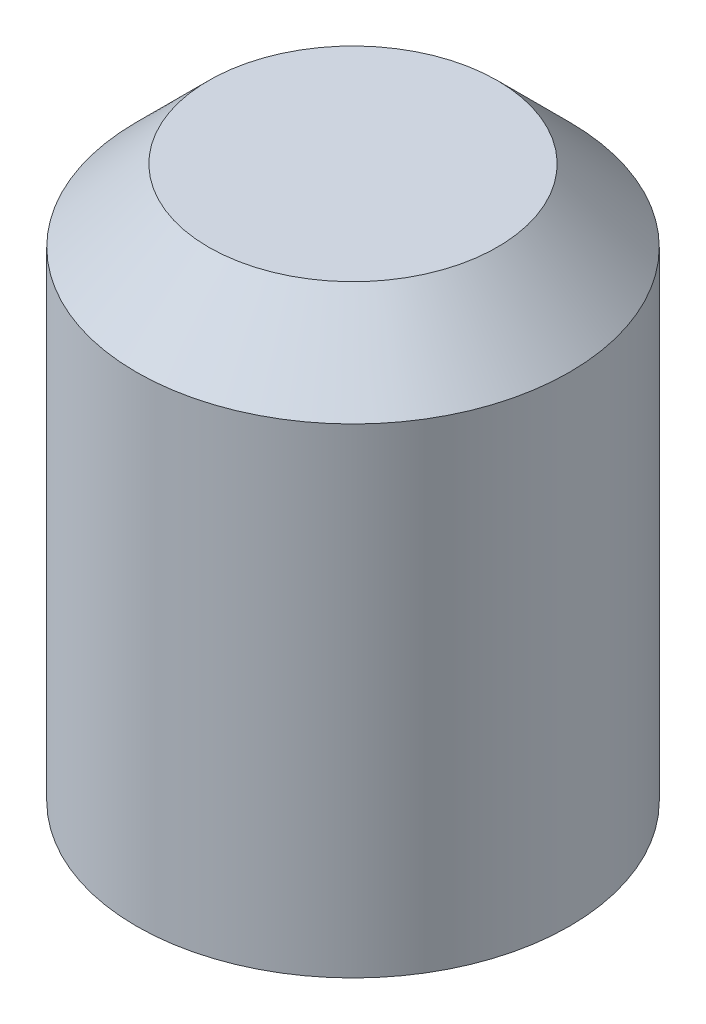
ISO-10303-21;
HEADER;
FILE_DESCRIPTION(('STEP AP214'),'2;1');
FILE_NAME('part.step','',(''),(''),'','','');
FILE_SCHEMA(('AUTOMOTIVE_DESIGN { 1 0 10303 214 1 1 1 1 }'));
ENDSEC;
DATA;
#1=APPLICATION_CONTEXT('core data for automotive mechanical design processes');
#2=APPLICATION_PROTOCOL_DEFINITION('international standard','automotive_design',2000,#1);
#3=PRODUCT_CONTEXT('',#1,'mechanical');
#4=PRODUCT('Part','Part','',(#3));
#5=PRODUCT_RELATED_PRODUCT_CATEGORY('part','',(#4));
#6=PRODUCT_DEFINITION_FORMATION('','',#4);
#7=PRODUCT_DEFINITION_CONTEXT('part definition',#1,'design');
#8=PRODUCT_DEFINITION('design','',#6,#7);
#9=PRODUCT_DEFINITION_SHAPE('','',#8);
#10=(LENGTH_UNIT() NAMED_UNIT(*) SI_UNIT(.MILLI.,.METRE.));
#11=(NAMED_UNIT(*) PLANE_ANGLE_UNIT() SI_UNIT($,.RADIAN.));
#12=(NAMED_UNIT(*) SI_UNIT($,.STERADIAN.) SOLID_ANGLE_UNIT());
#13=UNCERTAINTY_MEASURE_WITH_UNIT(LENGTH_MEASURE(1.E-05),#10,'distance_accuracy_value','');
#14=(GEOMETRIC_REPRESENTATION_CONTEXT(3) GLOBAL_UNCERTAINTY_ASSIGNED_CONTEXT((#13)) GLOBAL_UNIT_ASSIGNED_CONTEXT((#10,
#11,#12)) REPRESENTATION_CONTEXT('',''));
#15=CARTESIAN_POINT('',(0.,0.,0.));
#16=DIRECTION('',(0.,0.,1.));
#17=DIRECTION('',(1.,0.,0.));
#18=AXIS2_PLACEMENT_3D('',#15,#16,#17);
#19=CARTESIAN_POINT('',(-5.4,-6.05,0.));
#20=DIRECTION('',(0.,1.,0.));
#21=DIRECTION('',(0.,0.,1.));
#22=AXIS2_PLACEMENT_3D('',#19,#20,#21);
#23=PLANE('',#22);
#24=DIRECTION('',(-1.,0.,0.));
#25=VECTOR('',#24,1.);
#26=CARTESIAN_POINT('',(-5.83301270189222,-6.05,-0.75));
#27=LINE('',#26,#25);
#28=CARTESIAN_POINT('',(-5.83301270189222,-6.05,-0.75));
#29=VERTEX_POINT('',#28);
#30=CARTESIAN_POINT('',(-4.96698729810778,-6.05,-0.75));
#31=VERTEX_POINT('',#30);
#32=EDGE_CURVE('E116',#29,#31,#27,.F.);
#33=ORIENTED_EDGE('',*,*,#32,.T.);
#34=DIRECTION('',(-0.5,0.,-0.866025403784439));
#35=VECTOR('',#34,1.);
#36=CARTESIAN_POINT('',(-4.96698729810778,-6.05,-0.75));
#37=LINE('',#36,#35);
#38=CARTESIAN_POINT('',(-4.53397459621556,-6.05,0.));
#39=VERTEX_POINT('',#38);
#40=EDGE_CURVE('E82',#31,#39,#37,.F.);
#41=ORIENTED_EDGE('',*,*,#40,.T.);
#42=DIRECTION('',(0.5,0.,-0.866025403784439));
#43=VECTOR('',#42,1.);
#44=CARTESIAN_POINT('',(-4.53397459621556,-6.05,0.));
#45=LINE('',#44,#43);
#46=CARTESIAN_POINT('',(-4.96698729810778,-6.05,0.75));
#47=VERTEX_POINT('',#46);
#48=EDGE_CURVE('E84',#39,#47,#45,.F.);
#49=ORIENTED_EDGE('',*,*,#48,.T.);
#50=DIRECTION('',(1.,0.,0.));
#51=VECTOR('',#50,1.);
#52=CARTESIAN_POINT('',(-4.96698729810778,-6.05,0.75));
#53=LINE('',#52,#51);
#54=CARTESIAN_POINT('',(-5.83301270189222,-6.05,0.75));
#55=VERTEX_POINT('',#54);
#56=EDGE_CURVE('E85',#47,#55,#53,.F.);
#57=ORIENTED_EDGE('',*,*,#56,.T.);
#58=DIRECTION('',(0.5,0.,0.866025403784439));
#59=VECTOR('',#58,1.);
#60=CARTESIAN_POINT('',(-5.83301270189222,-6.05,0.75));
#61=LINE('',#60,#59);
#62=CARTESIAN_POINT('',(-6.26602540378444,-6.05,0.));
#63=VERTEX_POINT('',#62);
#64=EDGE_CURVE('E71',#55,#63,#61,.F.);
#65=ORIENTED_EDGE('',*,*,#64,.T.);
#66=DIRECTION('',(-0.5,0.,0.866025403784439));
#67=VECTOR('',#66,1.);
#68=CARTESIAN_POINT('',(-6.26602540378444,-6.05,0.));
#69=LINE('',#68,#67);
#70=EDGE_CURVE('E105',#63,#29,#69,.F.);
#71=ORIENTED_EDGE('',*,*,#70,.T.);
#72=EDGE_LOOP('',(#33,#41,#49,#57,#65,#71));
#73=FACE_BOUND('',#72,.T.);
#74=ADVANCED_FACE('F17',(#73),#23,.F.);
#75=CARTESIAN_POINT('',(-4.96698729810778,-7.25,0.75));
#76=DIRECTION('',(0.,0.,1.));
#77=DIRECTION('',(1.,0.,0.));
#78=AXIS2_PLACEMENT_3D('',#75,#76,#77);
#79=PLANE('',#78);
#80=DIRECTION('',(0.,1.,0.));
#81=VECTOR('',#80,1.);
#82=CARTESIAN_POINT('',(-5.83301270189222,-7.25,0.75));
#83=LINE('',#82,#81);
#84=CARTESIAN_POINT('',(-5.83301270192332,-7.24999999999689,0.749999999922893));
#85=VERTEX_POINT('',#84);
#86=EDGE_CURVE('E91',#85,#55,#83,.T.);
#87=ORIENTED_EDGE('',*,*,#86,.T.);
#88=ORIENTED_EDGE('',*,*,#56,.F.);
#89=DIRECTION('',(0.,1.,0.));
#90=VECTOR('',#89,1.);
#91=CARTESIAN_POINT('',(-4.96698729810778,-7.25,0.75));
#92=LINE('',#91,#90);
#93=CARTESIAN_POINT('',(-4.96698729813004,-7.25000000000077,0.749999999961446));
#94=VERTEX_POINT('',#93);
#95=EDGE_CURVE('E58',#47,#94,#92,.F.);
#96=ORIENTED_EDGE('',*,*,#95,.T.);
#97=CARTESIAN_POINT('',(-4.96698729813633,-7.25000000002462,0.749999999990233));
#98=CARTESIAN_POINT('',(-5.00253334721182,-7.23973766484959,0.749999999996492));
#99=CARTESIAN_POINT('',(-5.03836059709235,-7.23034220749079,0.74999999999906));
#100=CARTESIAN_POINT('',(-5.11059708571942,-7.21373690239262,0.750000000000942));
#101=CARTESIAN_POINT('',(-5.14700743835464,-7.20653194482124,0.75000000000025));
#102=CARTESIAN_POINT('',(-5.21941958689425,-7.1949455007837,0.749999999999756));
#103=CARTESIAN_POINT('',(-5.25541118774583,-7.19050224024818,0.749999999999935));
#104=CARTESIAN_POINT('',(-5.32760203794008,-7.18453742652163,0.750000000000065));
#105=CARTESIAN_POINT('',(-5.36380101896727,-7.18301270192084,0.750000000000017));
#106=CARTESIAN_POINT('',(-5.43619898102244,-7.18301270192055,0.749999999999983));
#107=CARTESIAN_POINT('',(-5.47239796205041,-7.18453742652112,0.749999999999995));
#108=CARTESIAN_POINT('',(-5.54458881224627,-7.19050224024725,0.750000000000005));
#109=CARTESIAN_POINT('',(-5.58058041309869,-7.19494550078256,0.750000000000001));
#110=CARTESIAN_POINT('',(-5.65299256163985,-7.20653194482036,0.749999999999999));
#111=CARTESIAN_POINT('',(-5.68940291427578,-7.21373690239221,0.749999999999999));
#112=CARTESIAN_POINT('',(-5.76163940290473,-7.23034220748943,0.750000000000001));
#113=CARTESIAN_POINT('',(-5.79746665278644,-7.23973766484681,0.750000000000001));
#114=CARTESIAN_POINT('',(-5.83301270186367,-7.25000000001823,0.75));
#115=B_SPLINE_CURVE_WITH_KNOTS('',3,(#97,#98,#99,#100,#101,#102,#103,#104,#105,#106,#107,#108,
#109,#110,#111,#112,#113,#114),.UNSPECIFIED.,.F.,.F.,(4,2,2,2,2,2,2,2,4),(0.,0.111027523460428,
0.222301119765626,0.330986572162821,0.439553854962632,0.548121137764763,0.656806590164309,
0.768080186471947,0.879107709934705),.UNSPECIFIED.);
#116=EDGE_CURVE('E20',#94,#85,#115,.T.);
#117=ORIENTED_EDGE('',*,*,#116,.T.);
#118=EDGE_LOOP('',(#87,#88,#96,#117));
#119=FACE_BOUND('',#118,.T.);
#120=ADVANCED_FACE('F89',(#119),#79,.F.);
#121=CARTESIAN_POINT('',(-4.53397459621556,-7.25,0.));
#122=DIRECTION('',(0.866025403784439,0.,0.5));
#123=DIRECTION('',(0.5,0.,-0.866025403784439));
#124=AXIS2_PLACEMENT_3D('',#121,#122,#123);
#125=PLANE('',#124);
#126=ORIENTED_EDGE('',*,*,#95,.F.);
#127=ORIENTED_EDGE('',*,*,#48,.F.);
#128=DIRECTION('',(0.,1.,0.));
#129=VECTOR('',#128,1.);
#130=CARTESIAN_POINT('',(-4.53397459621556,-7.25,0.));
#131=LINE('',#130,#129);
#132=CARTESIAN_POINT('',(-4.53397459626008,-7.25000000000077,0.));
#133=VERTEX_POINT('',#132);
#134=EDGE_CURVE('E97',#39,#133,#131,.F.);
#135=ORIENTED_EDGE('',*,*,#134,.T.);
#136=CARTESIAN_POINT('',(-4.53397459623829,-7.25000000002462,1.98427768303885E-11));
#137=CARTESIAN_POINT('',(-4.55300288193605,-7.23901082830645,0.0329579576418092));
#138=CARTESIAN_POINT('',(-4.57219541964067,-7.22901675269572,0.0662004080775304));
#139=CARTESIAN_POINT('',(-4.61091280108104,-7.21157239453197,0.133260879872035));
#140=CARTESIAN_POINT('',(-4.63043833252598,-7.20412828245993,0.167080092378077));
#141=CARTESIAN_POINT('',(-4.66924742521379,-7.1925409848509,0.234299412708026));
#142=CARTESIAN_POINT('',(-4.68852501685474,-7.18832067044876,0.267689180878064));
#143=CARTESIAN_POINT('',(-4.72717086026949,-7.18328343804382,0.334625745174027));
#144=CARTESIAN_POINT('',(-4.74653897167252,-7.18246234777618,0.368172298170642));
#145=CARTESIAN_POINT('',(-4.78272621006236,-7.1841748588689,0.430850433647387));
#146=CARTESIAN_POINT('',(-4.79955076723974,-7.18628798200753,0.459991421493473));
#147=CARTESIAN_POINT('',(-4.83309027509369,-7.19298398781146,0.518083553157391));
#148=CARTESIAN_POINT('',(-4.84980510985265,-7.19756915558054,0.547034496200022));
#149=CARTESIAN_POINT('',(-4.88341371225658,-7.2090311875406,0.605246303134993));
#150=CARTESIAN_POINT('',(-4.90030322842515,-7.21595661586676,0.634499803254222));
#151=CARTESIAN_POINT('',(-4.93383042648646,-7.23167441034119,0.692570613731831));
#152=CARTESIAN_POINT('',(-4.95046853757001,-7.24046308580387,0.721388667470523));
#153=CARTESIAN_POINT('',(-4.96698729809358,-7.25000000001827,0.749999999975404));
#154=B_SPLINE_CURVE_WITH_KNOTS('',3,(#136,#137,#138,#139,#140,#141,#142,#143,#144,#145,#146,
#147,#148,#149,#150,#151,#152,#153),.UNSPECIFIED.,.F.,.F.,(4,2,2,2,2,2,2,2,4),(0.,
0.118881004358965,0.238047681439854,0.354265352356804,0.47034033338114,0.571390418521876,
0.672534072698116,0.775920608446918,0.879104240070542),.UNSPECIFIED.);
#155=EDGE_CURVE('E95',#133,#94,#154,.T.);
#156=ORIENTED_EDGE('',*,*,#155,.T.);
#157=EDGE_LOOP('',(#126,#127,#135,#156));
#158=FACE_BOUND('',#157,.T.);
#159=ADVANCED_FACE('F93',(#158),#125,.F.);
#160=CARTESIAN_POINT('',(-4.96698729810778,-7.25,-0.75));
#161=DIRECTION('',(0.866025403784439,0.,-0.5));
#162=DIRECTION('',(-0.5,0.,-0.866025403784439));
#163=AXIS2_PLACEMENT_3D('',#160,#161,#162);
#164=PLANE('',#163);
#165=ORIENTED_EDGE('',*,*,#134,.F.);
#166=ORIENTED_EDGE('',*,*,#40,.F.);
#167=DIRECTION('',(0.,1.,0.));
#168=VECTOR('',#167,1.);
#169=CARTESIAN_POINT('',(-4.96698729810778,-7.25,-0.75));
#170=LINE('',#169,#168);
#171=CARTESIAN_POINT('',(-4.96698729813004,-7.25000000000077,-0.749999999961447));
#172=VERTEX_POINT('',#171);
#173=EDGE_CURVE('E108',#31,#172,#170,.F.);
#174=ORIENTED_EDGE('',*,*,#173,.T.);
#175=CARTESIAN_POINT('',(-4.96698729810196,-7.25000000002462,-0.749999999970391));
#176=CARTESIAN_POINT('',(-4.94795901239337,-7.23901082830645,-0.717042042354683));
#177=CARTESIAN_POINT('',(-4.9287664746843,-7.22901675269572,-0.68379959192153));
#178=CARTESIAN_POINT('',(-4.89004909324067,-7.21157239453197,-0.616739120128908));
#179=CARTESIAN_POINT('',(-4.87052356179693,-7.20412828245993,-0.582919907622173));
#180=CARTESIAN_POINT('',(-4.83171446910997,-7.1925409848509,-0.515700587291732));
#181=CARTESIAN_POINT('',(-4.81243687746872,-7.18832067044876,-0.482310819121872));
#182=CARTESIAN_POINT('',(-4.77379103405374,-7.18328343804382,-0.415374254826039));
#183=CARTESIAN_POINT('',(-4.75442292265079,-7.18246234777618,-0.381827701829375));
#184=CARTESIAN_POINT('',(-4.718235684261,-7.1841748588689,-0.3191495663526));
#185=CARTESIAN_POINT('',(-4.70141112708361,-7.18628798200753,-0.290008578506525));
#186=CARTESIAN_POINT('',(-4.66787161922964,-7.19298398781146,-0.231916446842614));
#187=CARTESIAN_POINT('',(-4.65115678447069,-7.19756915558054,-0.20296550379998));
#188=CARTESIAN_POINT('',(-4.61754818206677,-7.2090311875406,-0.144753696865007));
#189=CARTESIAN_POINT('',(-4.60065866589819,-7.21595661586676,-0.115500196745779));
#190=CARTESIAN_POINT('',(-4.56713146783688,-7.23167441034119,-0.0574293862681701));
#191=CARTESIAN_POINT('',(-4.55049335675333,-7.24046308580387,-0.0286113325294788));
#192=CARTESIAN_POINT('',(-4.53397459622976,-7.25000000001827,-2.45963588615092E-11));
#193=B_SPLINE_CURVE_WITH_KNOTS('',3,(#175,#176,#177,#178,#179,#180,#181,#182,#183,#184,#185,
#186,#187,#188,#189,#190,#191,#192),.UNSPECIFIED.,.F.,.F.,(4,2,2,2,2,2,2,2,4),(0.,
0.118881004358965,0.238047681439854,0.354265352356803,0.470340333381139,0.571390418521875,
0.672534072698115,0.775920608446917,0.879104240070541),.UNSPECIFIED.);
#194=EDGE_CURVE('E190',#172,#133,#193,.T.);
#195=ORIENTED_EDGE('',*,*,#194,.T.);
#196=EDGE_LOOP('',(#165,#166,#174,#195));
#197=FACE_BOUND('',#196,.T.);
#198=ADVANCED_FACE('F199',(#197),#164,.F.);
#199=CARTESIAN_POINT('',(-5.83301270189222,-7.25,-0.75));
#200=DIRECTION('',(0.,0.,-1.));
#201=DIRECTION('',(-1.,0.,0.));
#202=AXIS2_PLACEMENT_3D('',#199,#200,#201);
#203=PLANE('',#202);
#204=ORIENTED_EDGE('',*,*,#173,.F.);
#205=ORIENTED_EDGE('',*,*,#32,.F.);
#206=DIRECTION('',(0.,1.,0.));
#207=VECTOR('',#206,1.);
#208=CARTESIAN_POINT('',(-5.83301270189222,-7.25,-0.75));
#209=LINE('',#208,#207);
#210=CARTESIAN_POINT('',(-5.83301270186996,-7.25000000000788,-0.749999999961447));
#211=VERTEX_POINT('',#210);
#212=EDGE_CURVE('E107',#29,#211,#209,.F.);
#213=ORIENTED_EDGE('',*,*,#212,.T.);
#214=CARTESIAN_POINT('',(-5.8330127018724,-7.25000000002356,-0.749999999995703));
#215=CARTESIAN_POINT('',(-5.79746665279532,-7.23973766485022,-0.749999999998457));
#216=CARTESIAN_POINT('',(-5.7616394029135,-7.23034220749189,-0.749999999999586));
#217=CARTESIAN_POINT('',(-5.68940291428408,-7.21373690239366,-0.750000000000415));
#218=CARTESIAN_POINT('',(-5.65299256164779,-7.20653194482175,-0.75000000000011));
#219=CARTESIAN_POINT('',(-5.58058041310595,-7.19494550078361,-0.749999999999893));
#220=CARTESIAN_POINT('',(-5.5445888122532,-7.19050224024802,-0.749999999999971));
#221=CARTESIAN_POINT('',(-5.47239796205666,-7.18453742652144,-0.750000000000029));
#222=CARTESIAN_POINT('',(-5.43619898102833,-7.18301270192069,-0.750000000000008));
#223=CARTESIAN_POINT('',(-5.36380101897247,-7.1830127019207,-0.749999999999992));
#224=CARTESIAN_POINT('',(-5.32760203794494,-7.18453742652139,-0.749999999999998));
#225=CARTESIAN_POINT('',(-5.25541118774995,-7.19050224024768,-0.750000000000002));
#226=CARTESIAN_POINT('',(-5.21941958689797,-7.19494550078303,-0.750000000000001));
#227=CARTESIAN_POINT('',(-5.14700743835774,-7.20653194482082,-0.749999999999999));
#228=CARTESIAN_POINT('',(-5.11059708572229,-7.21373690239262,-0.75));
#229=CARTESIAN_POINT('',(-5.0383605970943,-7.23034220748968,-0.75));
#230=CARTESIAN_POINT('',(-5.00253334721309,-7.23973766484695,-0.750000000000001));
#231=CARTESIAN_POINT('',(-4.96698729813633,-7.25000000001823,-0.75));
#232=B_SPLINE_CURVE_WITH_KNOTS('',3,(#214,#215,#216,#217,#218,#219,#220,#221,#222,#223,#224,
#225,#226,#227,#228,#229,#230,#231),.UNSPECIFIED.,.F.,.F.,(4,2,2,2,2,2,2,2,4),(0.,
0.111027523463793,0.222301119772486,0.330986572173132,0.439553854976337,0.548121137777162,
0.65680659017543,0.768080186481618,0.879107709942885),.UNSPECIFIED.);
#233=EDGE_CURVE('E184',#211,#172,#232,.T.);
#234=ORIENTED_EDGE('',*,*,#233,.T.);
#235=EDGE_LOOP('',(#204,#205,#213,#234));
#236=FACE_BOUND('',#235,.T.);
#237=ADVANCED_FACE('F195',(#236),#203,.F.);
#238=CARTESIAN_POINT('',(-6.26602540378444,-7.25,0.));
#239=DIRECTION('',(-0.866025403784439,0.,-0.5));
#240=DIRECTION('',(-0.5,0.,0.866025403784439));
#241=AXIS2_PLACEMENT_3D('',#238,#239,#240);
#242=PLANE('',#241);
#243=ORIENTED_EDGE('',*,*,#212,.F.);
#244=ORIENTED_EDGE('',*,*,#70,.F.);
#245=DIRECTION('',(0.,1.,0.));
#246=VECTOR('',#245,1.);
#247=CARTESIAN_POINT('',(-6.26602540378444,-7.25,0.));
#248=LINE('',#247,#246);
#249=CARTESIAN_POINT('',(-6.26602540373992,-7.25000000000077,0.));
#250=VERTEX_POINT('',#249);
#251=EDGE_CURVE('E39',#63,#250,#248,.F.);
#252=ORIENTED_EDGE('',*,*,#251,.T.);
#253=CARTESIAN_POINT('',(-6.2660254037617,-7.25000000002462,-1.98433030964582E-11));
#254=CARTESIAN_POINT('',(-6.24699711806395,-7.23901082830645,-0.0329579576418126));
#255=CARTESIAN_POINT('',(-6.22780458035933,-7.22901675269572,-0.0662004080775363));
#256=CARTESIAN_POINT('',(-6.18908719891896,-7.21157239453197,-0.133260879872046));
#257=CARTESIAN_POINT('',(-6.16956166747401,-7.20412828245993,-0.16708009237809));
#258=CARTESIAN_POINT('',(-6.1307525747862,-7.1925409848509,-0.23429941270804));
#259=CARTESIAN_POINT('',(-6.11147498314526,-7.18832067044876,-0.267689180878075));
#260=CARTESIAN_POINT('',(-6.07282913973051,-7.18328343804382,-0.334625745174033));
#261=CARTESIAN_POINT('',(-6.05346102832747,-7.18246234777618,-0.368172298170645));
#262=CARTESIAN_POINT('',(-6.01727378993727,-7.18417485886892,-0.43085043364802));
#263=CARTESIAN_POINT('',(-6.00044923275953,-7.18628798200762,-0.459991421494736));
#264=CARTESIAN_POINT('',(-5.96690972490485,-7.1929839878118,-0.518083553159906));
#265=CARTESIAN_POINT('',(-5.95019489014554,-7.19756915558106,-0.547034496203157));
#266=CARTESIAN_POINT('',(-5.91658628774089,-7.20903118754156,-0.605246303139383));
#267=CARTESIAN_POINT('',(-5.89969677157195,-7.215956615868,-0.634499803259246));
#268=CARTESIAN_POINT('',(-5.86616957350992,-7.23167441034301,-0.692570613738102));
#269=CARTESIAN_POINT('',(-5.84953146242602,-7.24046308580602,-0.721388667477405));
#270=CARTESIAN_POINT('',(-5.8330127019021,-7.25000000002077,-0.749999999982889));
#271=B_SPLINE_CURVE_WITH_KNOTS('',3,(#253,#254,#255,#256,#257,#258,#259,#260,#261,#262,#263,
#264,#265,#266,#267,#268,#269,#270),.UNSPECIFIED.,.F.,.F.,(4,2,2,2,2,2,2,2,4),(0.,
0.118881004358974,0.238047681439872,0.354265352356813,0.470340333381139,0.571390418524065,
0.672534072702501,0.775920608453614,0.879104240079532),.UNSPECIFIED.);
#272=EDGE_CURVE('E155',#250,#211,#271,.T.);
#273=ORIENTED_EDGE('',*,*,#272,.T.);
#274=EDGE_LOOP('',(#243,#244,#252,#273));
#275=FACE_BOUND('',#274,.T.);
#276=ADVANCED_FACE('F198',(#275),#242,.F.);
#277=CARTESIAN_POINT('',(-5.83301270189222,-7.25,0.75));
#278=DIRECTION('',(-0.866025403784439,0.,0.5));
#279=DIRECTION('',(0.5,0.,0.866025403784439));
#280=AXIS2_PLACEMENT_3D('',#277,#278,#279);
#281=PLANE('',#280);
#282=ORIENTED_EDGE('',*,*,#251,.F.);
#283=ORIENTED_EDGE('',*,*,#64,.F.);
#284=ORIENTED_EDGE('',*,*,#86,.F.);
#285=CARTESIAN_POINT('',(-5.83301270189804,-7.25000000002462,0.749999999970391));
#286=CARTESIAN_POINT('',(-5.85204098760663,-7.23901082830645,0.717042042354683));
#287=CARTESIAN_POINT('',(-5.8712335253157,-7.22901675269572,0.683799591921529));
#288=CARTESIAN_POINT('',(-5.90995090675933,-7.21157239453197,0.616739120128908));
#289=CARTESIAN_POINT('',(-5.92947643820307,-7.20412828245993,0.582919907622173));
#290=CARTESIAN_POINT('',(-5.96828553089003,-7.1925409848509,0.515700587291732));
#291=CARTESIAN_POINT('',(-5.98756312253128,-7.18832067044876,0.482310819121872));
#292=CARTESIAN_POINT('',(-6.02620896594626,-7.18328343804382,0.415374254826038));
#293=CARTESIAN_POINT('',(-6.04557707734921,-7.18246234777618,0.381827701829375));
#294=CARTESIAN_POINT('',(-6.081764315739,-7.1841748588689,0.3191495663526));
#295=CARTESIAN_POINT('',(-6.09858887291639,-7.18628798200753,0.290008578506524));
#296=CARTESIAN_POINT('',(-6.13212838077036,-7.19298398781146,0.231916446842615));
#297=CARTESIAN_POINT('',(-6.14884321552931,-7.19756915558054,0.202965503799981));
#298=CARTESIAN_POINT('',(-6.18245181793323,-7.2090311875406,0.144753696865008));
#299=CARTESIAN_POINT('',(-6.19934133410181,-7.21595661586676,0.115500196745779));
#300=CARTESIAN_POINT('',(-6.23286853216312,-7.23167441034119,0.0574293862681695));
#301=CARTESIAN_POINT('',(-6.24950664324667,-7.24046308580387,0.0286113325294778));
#302=CARTESIAN_POINT('',(-6.26602540377024,-7.25000000001827,2.45953151783073E-11));
#303=B_SPLINE_CURVE_WITH_KNOTS('',3,(#285,#286,#287,#288,#289,#290,#291,#292,#293,#294,#295,
#296,#297,#298,#299,#300,#301,#302),.UNSPECIFIED.,.F.,.F.,(4,2,2,2,2,2,2,2,4),(0.,
0.118881004358965,0.238047681439853,0.354265352356803,0.470340333381139,0.571390418521875,
0.672534072698114,0.775920608446917,0.879104240070542),.UNSPECIFIED.);
#304=EDGE_CURVE('E148',#85,#250,#303,.T.);
#305=ORIENTED_EDGE('',*,*,#304,.T.);
#306=EDGE_LOOP('',(#282,#283,#284,#305));
#307=FACE_BOUND('',#306,.T.);
#308=ADVANCED_FACE('F162',(#307),#281,.F.);
#309=CARTESIAN_POINT('',(-5.4,-7.24999999994225,0.));
#310=DIRECTION('',(0.,-1.,0.));
#311=DIRECTION('',(0.,0.,-1.));
#312=AXIS2_PLACEMENT_3D('',#309,#310,#311);
#313=CONICAL_SURFACE('',#312,0.86602540363856,1.04719755120955);
#314=ORIENTED_EDGE('',*,*,#116,.F.);
#315=CARTESIAN_POINT('',(-5.4,-7.24999999997507,0.));
#316=DIRECTION('',(0.,-1.,0.));
#317=DIRECTION('',(0.,0.,-1.));
#318=AXIS2_PLACEMENT_3D('',#315,#316,#317);
#319=CIRCLE('',#318,0.866025403695403);
#320=EDGE_CURVE('E145',#85,#94,#319,.F.);
#321=ORIENTED_EDGE('',*,*,#320,.F.);
#322=EDGE_LOOP('',(#314,#321));
#323=FACE_BOUND('',#322,.T.);
#324=ADVANCED_FACE('F215',(#323),#313,.F.);
#325=CARTESIAN_POINT('',(-5.4,-7.24999999994225,0.));
#326=DIRECTION('',(0.,-1.,0.));
#327=DIRECTION('',(0.,0.,-1.));
#328=AXIS2_PLACEMENT_3D('',#325,#326,#327);
#329=CONICAL_SURFACE('',#328,0.86602540363856,1.04719755134339);
#330=CARTESIAN_POINT('',(-5.4,-7.24999999997507,0.));
#331=DIRECTION('',(0.,-1.,0.));
#332=DIRECTION('',(0.,0.,-1.));
#333=AXIS2_PLACEMENT_3D('',#330,#331,#332);
#334=CIRCLE('',#333,0.866025403695404);
#335=EDGE_CURVE('E142',#94,#133,#334,.F.);
#336=ORIENTED_EDGE('',*,*,#335,.F.);
#337=ORIENTED_EDGE('',*,*,#155,.F.);
#338=EDGE_LOOP('',(#336,#337));
#339=FACE_BOUND('',#338,.T.);
#340=ADVANCED_FACE('F212',(#339),#329,.F.);
#341=CARTESIAN_POINT('',(-5.4,-7.24999999994225,0.));
#342=DIRECTION('',(0.,-1.,0.));
#343=DIRECTION('',(0.,0.,-1.));
#344=AXIS2_PLACEMENT_3D('',#341,#342,#343);
#345=CONICAL_SURFACE('',#344,0.86602540363856,1.04719755134339);
#346=CARTESIAN_POINT('',(-5.4,-7.24999999997507,0.));
#347=DIRECTION('',(0.,-1.,0.));
#348=DIRECTION('',(0.,0.,-1.));
#349=AXIS2_PLACEMENT_3D('',#346,#347,#348);
#350=CIRCLE('',#349,0.866025403695403);
#351=EDGE_CURVE('E139',#133,#172,#350,.F.);
#352=ORIENTED_EDGE('',*,*,#351,.F.);
#353=ORIENTED_EDGE('',*,*,#194,.F.);
#354=EDGE_LOOP('',(#352,#353));
#355=FACE_BOUND('',#354,.T.);
#356=ADVANCED_FACE('F180',(#355),#345,.F.);
#357=CARTESIAN_POINT('',(-5.4,-7.24999999994225,0.));
#358=DIRECTION('',(0.,-1.,0.));
#359=DIRECTION('',(0.,0.,-1.));
#360=AXIS2_PLACEMENT_3D('',#357,#358,#359);
#361=CONICAL_SURFACE('',#360,0.86602540363856,1.04719755120955);
#362=ORIENTED_EDGE('',*,*,#233,.F.);
#363=CARTESIAN_POINT('',(-5.4,-7.2500000000407,0.));
#364=DIRECTION('',(0.,-1.,0.));
#365=DIRECTION('',(0.,0.,-1.));
#366=AXIS2_PLACEMENT_3D('',#363,#364,#365);
#367=CIRCLE('',#366,0.86602540380909);
#368=EDGE_CURVE('E136',#172,#211,#367,.F.);
#369=ORIENTED_EDGE('',*,*,#368,.F.);
#370=EDGE_LOOP('',(#362,#369));
#371=FACE_BOUND('',#370,.T.);
#372=ADVANCED_FACE('F175',(#371),#361,.F.);
#373=CARTESIAN_POINT('',(-5.4,-7.24999999994225,0.));
#374=DIRECTION('',(0.,-1.,0.));
#375=DIRECTION('',(0.,0.,-1.));
#376=AXIS2_PLACEMENT_3D('',#373,#374,#375);
#377=CONICAL_SURFACE('',#376,0.86602540363856,1.04719755134339);
#378=CARTESIAN_POINT('',(-5.4,-7.24999999997507,0.));
#379=DIRECTION('',(0.,-1.,0.));
#380=DIRECTION('',(0.,0.,-1.));
#381=AXIS2_PLACEMENT_3D('',#378,#379,#380);
#382=CIRCLE('',#381,0.866025403695403);
#383=EDGE_CURVE('E133',#211,#250,#382,.F.);
#384=ORIENTED_EDGE('',*,*,#383,.F.);
#385=ORIENTED_EDGE('',*,*,#272,.F.);
#386=EDGE_LOOP('',(#384,#385));
#387=FACE_BOUND('',#386,.T.);
#388=ADVANCED_FACE('F169',(#387),#377,.F.);
#389=CARTESIAN_POINT('',(-5.4,-7.24999999994225,0.));
#390=DIRECTION('',(0.,-1.,0.));
#391=DIRECTION('',(0.,0.,-1.));
#392=AXIS2_PLACEMENT_3D('',#389,#390,#391);
#393=CONICAL_SURFACE('',#392,0.86602540363856,1.04719755134339);
#394=CARTESIAN_POINT('',(-5.4,-7.24999999997507,0.));
#395=DIRECTION('',(0.,-1.,0.));
#396=DIRECTION('',(0.,0.,-1.));
#397=AXIS2_PLACEMENT_3D('',#394,#395,#396);
#398=CIRCLE('',#397,0.866025403695403);
#399=EDGE_CURVE('E130',#250,#85,#398,.F.);
#400=ORIENTED_EDGE('',*,*,#399,.F.);
#401=ORIENTED_EDGE('',*,*,#304,.F.);
#402=EDGE_LOOP('',(#400,#401));
#403=FACE_BOUND('',#402,.T.);
#404=ADVANCED_FACE('F164',(#403),#393,.F.);
#405=CARTESIAN_POINT('',(-5.4,-7.25,1.02976270189222));
#406=DIRECTION('',(0.,-1.,0.));
#407=DIRECTION('',(0.,0.,-1.));
#408=AXIS2_PLACEMENT_3D('',#405,#406,#407);
#409=PLANE('',#408);
#410=ORIENTED_EDGE('',*,*,#383,.T.);
#411=ORIENTED_EDGE('',*,*,#399,.T.);
#412=ORIENTED_EDGE('',*,*,#320,.T.);
#413=ORIENTED_EDGE('',*,*,#335,.T.);
#414=ORIENTED_EDGE('',*,*,#351,.T.);
#415=ORIENTED_EDGE('',*,*,#368,.T.);
#416=EDGE_LOOP('',(#410,#411,#412,#413,#414,#415));
#417=FACE_BOUND('',#416,.T.);
#418=CARTESIAN_POINT('',(-5.4,-7.25000000000553,0.));
#419=DIRECTION('',(0.,1.,0.));
#420=DIRECTION('',(0.,0.,1.));
#421=AXIS2_PLACEMENT_3D('',#418,#419,#420);
#422=CIRCLE('',#421,1.1934999999994);
#423=CARTESIAN_POINT('',(-5.4,-7.25000000000553,1.1934999999994));
#424=VERTEX_POINT('',#423);
#425=EDGE_CURVE('E127',#424,#424,#422,.T.);
#426=ORIENTED_EDGE('',*,*,#425,.F.);
#427=EDGE_LOOP('',(#426));
#428=FACE_BOUND('',#427,.T.);
#429=ADVANCED_FACE('F168',(#417,#428),#409,.T.);
#430=CARTESIAN_POINT('',(-5.4,-3.25,0.499999999999999));
#431=DIRECTION('',(0.,1.,0.));
#432=DIRECTION('',(0.,0.,1.));
#433=AXIS2_PLACEMENT_3D('',#430,#431,#432);
#434=PLANE('',#433);
#435=CARTESIAN_POINT('',(-5.4,-3.25000000003683,0.));
#436=DIRECTION('',(0.,-1.,0.));
#437=DIRECTION('',(0.,0.,-1.));
#438=AXIS2_PLACEMENT_3D('',#435,#436,#437);
#439=CIRCLE('',#438,1.00000000014688);
#440=CARTESIAN_POINT('',(-5.4,-3.25000000003683,-1.00000000014688));
#441=VERTEX_POINT('',#440);
#442=EDGE_CURVE('E124',#441,#441,#439,.T.);
#443=ORIENTED_EDGE('',*,*,#442,.F.);
#444=EDGE_LOOP('',(#443));
#445=FACE_BOUND('',#444,.T.);
#446=ADVANCED_FACE('F240',(#445),#434,.T.);
#447=CARTESIAN_POINT('',(-5.4,-7.07304214262194,0.));
#448=DIRECTION('',(0.,1.,0.));
#449=DIRECTION('',(0.,0.,1.));
#450=AXIS2_PLACEMENT_3D('',#447,#448,#449);
#451=CONICAL_SURFACE('',#450,1.49999999973716,1.04719755112717);
#452=ORIENTED_EDGE('',*,*,#425,.T.);
#453=EDGE_LOOP('',(#452));
#454=FACE_BOUND('',#453,.T.);
#455=CARTESIAN_POINT('',(-5.4,-7.07304214249338,0.));
#456=DIRECTION('',(0.,-1.,0.));
#457=DIRECTION('',(0.,0.,-1.));
#458=AXIS2_PLACEMENT_3D('',#455,#456,#457);
#459=CIRCLE('',#458,1.5);
#460=CARTESIAN_POINT('',(-5.4,-7.07304214249338,-1.5));
#461=VERTEX_POINT('',#460);
#462=EDGE_CURVE('E30',#461,#461,#459,.F.);
#463=ORIENTED_EDGE('',*,*,#462,.F.);
#464=EDGE_LOOP('',(#463));
#465=FACE_BOUND('',#464,.T.);
#466=ADVANCED_FACE('F233',(#454,#465),#451,.T.);
#467=CARTESIAN_POINT('',(-5.4,-3.75000000008185,0.));
#468=DIRECTION('',(0.,-1.,0.));
#469=DIRECTION('',(0.,0.,-1.));
#470=AXIS2_PLACEMENT_3D('',#467,#468,#469);
#471=CONICAL_SURFACE('',#470,1.50000000013506,0.785398163340605);
#472=ORIENTED_EDGE('',*,*,#442,.T.);
#473=EDGE_LOOP('',(#472));
#474=FACE_BOUND('',#473,.T.);
#475=CARTESIAN_POINT('',(-5.4,-3.75,0.));
#476=DIRECTION('',(0.,-1.,0.));
#477=DIRECTION('',(0.,0.,-1.));
#478=AXIS2_PLACEMENT_3D('',#475,#476,#477);
#479=CIRCLE('',#478,1.5);
#480=CARTESIAN_POINT('',(-5.4,-3.75,-1.5));
#481=VERTEX_POINT('',#480);
#482=EDGE_CURVE('E11',#481,#481,#479,.T.);
#483=ORIENTED_EDGE('',*,*,#482,.F.);
#484=EDGE_LOOP('',(#483));
#485=FACE_BOUND('',#484,.T.);
#486=ADVANCED_FACE('F227',(#474,#485),#471,.T.);
#487=CARTESIAN_POINT('',(-5.4,-5.41152107124669,0.));
#488=DIRECTION('',(0.,-1.,0.));
#489=DIRECTION('',(0.,0.,-1.));
#490=AXIS2_PLACEMENT_3D('',#487,#488,#489);
#491=CYLINDRICAL_SURFACE('',#490,1.5);
#492=ORIENTED_EDGE('',*,*,#462,.T.);
#493=EDGE_LOOP('',(#492));
#494=FACE_BOUND('',#493,.T.);
#495=ORIENTED_EDGE('',*,*,#482,.T.);
#496=EDGE_LOOP('',(#495));
#497=FACE_BOUND('',#496,.T.);
#498=ADVANCED_FACE('F225',(#494,#497),#491,.T.);
#499=CLOSED_SHELL('',(#74,#120,#159,#198,#237,#276,#308,#324,#340,#356,#372,#388,#404,#429,#446,
#466,#486,#498));
#500=MANIFOLD_SOLID_BREP('B1',#499);
#501=ADVANCED_BREP_SHAPE_REPRESENTATION('',(#18,#500),#14);
#502=SHAPE_DEFINITION_REPRESENTATION(#9,#501);
ENDSEC;
END-ISO-10303-21;
